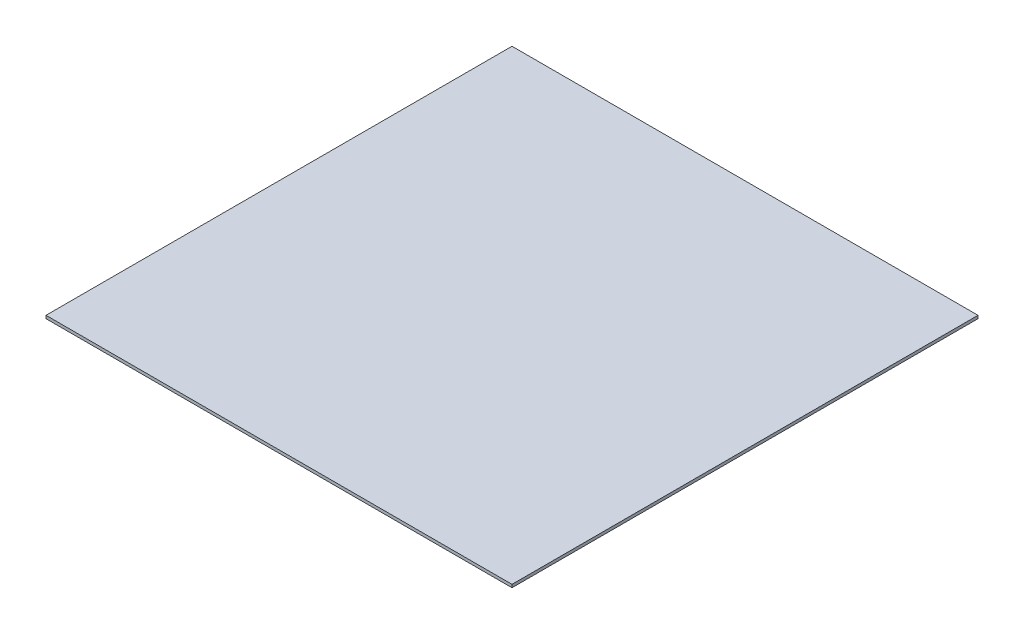
ISO-10303-21;
HEADER;
FILE_DESCRIPTION(('STEP AP214'),'2;1');
FILE_NAME('part.step','',(''),(''),'','','');
FILE_SCHEMA(('AUTOMOTIVE_DESIGN { 1 0 10303 214 1 1 1 1 }'));
ENDSEC;
DATA;
#1=APPLICATION_CONTEXT('core data for automotive mechanical design processes');
#2=APPLICATION_PROTOCOL_DEFINITION('international standard','automotive_design',2000,#1);
#3=PRODUCT_CONTEXT('',#1,'mechanical');
#4=PRODUCT('Part','Part','',(#3));
#5=PRODUCT_RELATED_PRODUCT_CATEGORY('part','',(#4));
#6=PRODUCT_DEFINITION_FORMATION('','',#4);
#7=PRODUCT_DEFINITION_CONTEXT('part definition',#1,'design');
#8=PRODUCT_DEFINITION('design','',#6,#7);
#9=PRODUCT_DEFINITION_SHAPE('','',#8);
#10=(LENGTH_UNIT() NAMED_UNIT(*) SI_UNIT(.MILLI.,.METRE.));
#11=(NAMED_UNIT(*) PLANE_ANGLE_UNIT() SI_UNIT($,.RADIAN.));
#12=(NAMED_UNIT(*) SI_UNIT($,.STERADIAN.) SOLID_ANGLE_UNIT());
#13=UNCERTAINTY_MEASURE_WITH_UNIT(LENGTH_MEASURE(1.E-05),#10,'distance_accuracy_value','');
#14=(GEOMETRIC_REPRESENTATION_CONTEXT(3) GLOBAL_UNCERTAINTY_ASSIGNED_CONTEXT((#13)) GLOBAL_UNIT_ASSIGNED_CONTEXT((#10,
#11,#12)) REPRESENTATION_CONTEXT('',''));
#15=CARTESIAN_POINT('',(0.,0.,0.));
#16=DIRECTION('',(0.,0.,1.));
#17=DIRECTION('',(1.,0.,0.));
#18=AXIS2_PLACEMENT_3D('',#15,#16,#17);
#19=CARTESIAN_POINT('',(-46.3540362527435,0.254,-28.8651507800966));
#20=DIRECTION('',(1.,0.,0.));
#21=DIRECTION('',(0.,0.,-1.));
#22=AXIS2_PLACEMENT_3D('',#19,#20,#21);
#23=PLANE('',#22);
#24=DIRECTION('',(0.,0.,1.));
#25=VECTOR('',#24,1.);
#26=CARTESIAN_POINT('',(-46.3540362527435,0.,-28.8651507800966));
#27=LINE('',#26,#25);
#28=CARTESIAN_POINT('',(-46.3540362527435,0.,-28.8651507800966));
#29=VERTEX_POINT('',#28);
#30=CARTESIAN_POINT('',(-46.3540362527434,0.,11.1348492199034));
#31=VERTEX_POINT('',#30);
#32=EDGE_CURVE('E96',#29,#31,#27,.T.);
#33=ORIENTED_EDGE('',*,*,#32,.T.);
#34=DIRECTION('',(0.,-1.,0.));
#35=VECTOR('',#34,1.);
#36=CARTESIAN_POINT('',(-46.3540362527434,0.254,11.1348492199034));
#37=LINE('',#36,#35);
#38=CARTESIAN_POINT('',(-46.3540362527434,0.254,11.1348492199034));
#39=VERTEX_POINT('',#38);
#40=EDGE_CURVE('E11',#39,#31,#37,.T.);
#41=ORIENTED_EDGE('',*,*,#40,.F.);
#42=DIRECTION('',(0.,0.,1.));
#43=VECTOR('',#42,1.);
#44=CARTESIAN_POINT('',(-46.3540362527435,0.254,-28.8651507800966));
#45=LINE('',#44,#43);
#46=CARTESIAN_POINT('',(-46.3540362527435,0.254,-28.8651507800966));
#47=VERTEX_POINT('',#46);
#48=EDGE_CURVE('E84',#47,#39,#45,.T.);
#49=ORIENTED_EDGE('',*,*,#48,.F.);
#50=DIRECTION('',(0.,-1.,0.));
#51=VECTOR('',#50,1.);
#52=CARTESIAN_POINT('',(-46.3540362527435,0.254,-28.8651507800966));
#53=LINE('',#52,#51);
#54=EDGE_CURVE('E92',#47,#29,#53,.T.);
#55=ORIENTED_EDGE('',*,*,#54,.T.);
#56=EDGE_LOOP('',(#33,#41,#49,#55));
#57=FACE_BOUND('',#56,.T.);
#58=ADVANCED_FACE('F33',(#57),#23,.F.);
#59=CARTESIAN_POINT('',(-46.3540362527434,0.254,11.1348492199034));
#60=DIRECTION('',(0.,0.,-1.));
#61=DIRECTION('',(-1.,0.,0.));
#62=AXIS2_PLACEMENT_3D('',#59,#60,#61);
#63=PLANE('',#62);
#64=DIRECTION('',(1.,0.,0.));
#65=VECTOR('',#64,1.);
#66=CARTESIAN_POINT('',(-46.3540362527434,0.,11.1348492199034));
#67=LINE('',#66,#65);
#68=CARTESIAN_POINT('',(-6.35403625274344,0.,11.1348492199034));
#69=VERTEX_POINT('',#68);
#70=EDGE_CURVE('E88',#31,#69,#67,.T.);
#71=ORIENTED_EDGE('',*,*,#70,.T.);
#72=DIRECTION('',(0.,-1.,0.));
#73=VECTOR('',#72,1.);
#74=CARTESIAN_POINT('',(-6.35403625274344,0.254,11.1348492199034));
#75=LINE('',#74,#73);
#76=CARTESIAN_POINT('',(-6.35403625274344,0.254,11.1348492199034));
#77=VERTEX_POINT('',#76);
#78=EDGE_CURVE('E41',#77,#69,#75,.T.);
#79=ORIENTED_EDGE('',*,*,#78,.F.);
#80=DIRECTION('',(1.,0.,0.));
#81=VECTOR('',#80,1.);
#82=CARTESIAN_POINT('',(-46.3540362527434,0.254,11.1348492199034));
#83=LINE('',#82,#81);
#84=EDGE_CURVE('E79',#39,#77,#83,.T.);
#85=ORIENTED_EDGE('',*,*,#84,.F.);
#86=ORIENTED_EDGE('',*,*,#40,.T.);
#87=EDGE_LOOP('',(#71,#79,#85,#86));
#88=FACE_BOUND('',#87,.T.);
#89=ADVANCED_FACE('F87',(#88),#63,.F.);
#90=CARTESIAN_POINT('',(-6.35403625274346,0.254,-28.8651507800966));
#91=DIRECTION('',(-1.,0.,0.));
#92=DIRECTION('',(0.,0.,1.));
#93=AXIS2_PLACEMENT_3D('',#90,#91,#92);
#94=PLANE('',#93);
#95=DIRECTION('',(0.,0.,-1.));
#96=VECTOR('',#95,1.);
#97=CARTESIAN_POINT('',(-6.35403625274346,0.,-28.8651507800966));
#98=LINE('',#97,#96);
#99=CARTESIAN_POINT('',(-6.35403625274346,0.,-28.8651507800966));
#100=VERTEX_POINT('',#99);
#101=EDGE_CURVE('E66',#69,#100,#98,.T.);
#102=ORIENTED_EDGE('',*,*,#101,.T.);
#103=DIRECTION('',(0.,-1.,0.));
#104=VECTOR('',#103,1.);
#105=CARTESIAN_POINT('',(-6.35403625274346,0.254,-28.8651507800966));
#106=LINE('',#105,#104);
#107=CARTESIAN_POINT('',(-6.35403625274346,0.254,-28.8651507800966));
#108=VERTEX_POINT('',#107);
#109=EDGE_CURVE('E89',#108,#100,#106,.T.);
#110=ORIENTED_EDGE('',*,*,#109,.F.);
#111=DIRECTION('',(0.,0.,-1.));
#112=VECTOR('',#111,1.);
#113=CARTESIAN_POINT('',(-6.35403625274346,0.254,-28.8651507800966));
#114=LINE('',#113,#112);
#115=EDGE_CURVE('E82',#77,#108,#114,.T.);
#116=ORIENTED_EDGE('',*,*,#115,.F.);
#117=ORIENTED_EDGE('',*,*,#78,.T.);
#118=EDGE_LOOP('',(#102,#110,#116,#117));
#119=FACE_BOUND('',#118,.T.);
#120=ADVANCED_FACE('F90',(#119),#94,.F.);
#121=CARTESIAN_POINT('',(-46.3540362527435,0.254,-28.8651507800966));
#122=DIRECTION('',(0.,0.,1.));
#123=DIRECTION('',(1.,0.,0.));
#124=AXIS2_PLACEMENT_3D('',#121,#122,#123);
#125=PLANE('',#124);
#126=DIRECTION('',(-1.,0.,0.));
#127=VECTOR('',#126,1.);
#128=CARTESIAN_POINT('',(-46.3540362527435,0.,-28.8651507800966));
#129=LINE('',#128,#127);
#130=EDGE_CURVE('E72',#100,#29,#129,.T.);
#131=ORIENTED_EDGE('',*,*,#130,.T.);
#132=ORIENTED_EDGE('',*,*,#54,.F.);
#133=DIRECTION('',(-1.,0.,0.));
#134=VECTOR('',#133,1.);
#135=CARTESIAN_POINT('',(-46.3540362527435,0.254,-28.8651507800966));
#136=LINE('',#135,#134);
#137=EDGE_CURVE('E49',#108,#47,#136,.T.);
#138=ORIENTED_EDGE('',*,*,#137,.F.);
#139=ORIENTED_EDGE('',*,*,#109,.T.);
#140=EDGE_LOOP('',(#131,#132,#138,#139));
#141=FACE_BOUND('',#140,.T.);
#142=ADVANCED_FACE('F103',(#141),#125,.F.);
#143=CARTESIAN_POINT('',(-46.3540362527434,0.254,11.1348492199034));
#144=DIRECTION('',(0.,1.,0.));
#145=DIRECTION('',(0.,0.,1.));
#146=AXIS2_PLACEMENT_3D('',#143,#144,#145);
#147=PLANE('',#146);
#148=ORIENTED_EDGE('',*,*,#48,.T.);
#149=ORIENTED_EDGE('',*,*,#84,.T.);
#150=ORIENTED_EDGE('',*,*,#115,.T.);
#151=ORIENTED_EDGE('',*,*,#137,.T.);
#152=EDGE_LOOP('',(#148,#149,#150,#151));
#153=FACE_BOUND('',#152,.T.);
#154=ADVANCED_FACE('F80',(#153),#147,.T.);
#155=CARTESIAN_POINT('',(-46.3540362527434,0.,11.1348492199034));
#156=DIRECTION('',(0.,1.,0.));
#157=DIRECTION('',(0.,0.,1.));
#158=AXIS2_PLACEMENT_3D('',#155,#156,#157);
#159=PLANE('',#158);
#160=ORIENTED_EDGE('',*,*,#32,.F.);
#161=ORIENTED_EDGE('',*,*,#130,.F.);
#162=ORIENTED_EDGE('',*,*,#101,.F.);
#163=ORIENTED_EDGE('',*,*,#70,.F.);
#164=EDGE_LOOP('',(#160,#161,#162,#163));
#165=FACE_BOUND('',#164,.T.);
#166=ADVANCED_FACE('F106',(#165),#159,.F.);
#167=CLOSED_SHELL('',(#58,#89,#120,#142,#154,#166));
#168=MANIFOLD_SOLID_BREP('B2',#167);
#169=ADVANCED_BREP_SHAPE_REPRESENTATION('',(#18,#168),#14);
#170=SHAPE_DEFINITION_REPRESENTATION(#9,#169);
ENDSEC;
END-ISO-10303-21;
